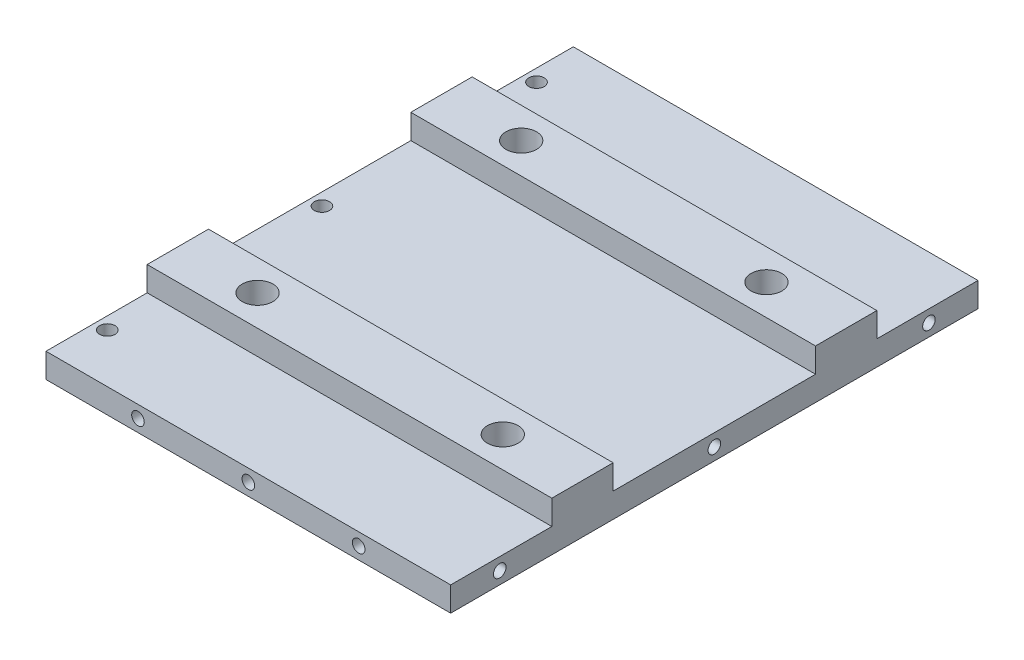
ISO-10303-21;
HEADER;
FILE_DESCRIPTION(('STEP AP214'),'2;1');
FILE_NAME('part.step','',(''),(''),'','','');
FILE_SCHEMA(('AUTOMOTIVE_DESIGN { 1 0 10303 214 1 1 1 1 }'));
ENDSEC;
DATA;
#1=APPLICATION_CONTEXT('core data for automotive mechanical design processes');
#2=APPLICATION_PROTOCOL_DEFINITION('international standard','automotive_design',2000,#1);
#3=PRODUCT_CONTEXT('',#1,'mechanical');
#4=PRODUCT('Part','Part','',(#3));
#5=PRODUCT_RELATED_PRODUCT_CATEGORY('part','',(#4));
#6=PRODUCT_DEFINITION_FORMATION('','',#4);
#7=PRODUCT_DEFINITION_CONTEXT('part definition',#1,'design');
#8=PRODUCT_DEFINITION('design','',#6,#7);
#9=PRODUCT_DEFINITION_SHAPE('','',#8);
#10=(LENGTH_UNIT() NAMED_UNIT(*) SI_UNIT(.MILLI.,.METRE.));
#11=(NAMED_UNIT(*) PLANE_ANGLE_UNIT() SI_UNIT($,.RADIAN.));
#12=(NAMED_UNIT(*) SI_UNIT($,.STERADIAN.) SOLID_ANGLE_UNIT());
#13=UNCERTAINTY_MEASURE_WITH_UNIT(LENGTH_MEASURE(1.E-05),#10,'distance_accuracy_value','');
#14=(GEOMETRIC_REPRESENTATION_CONTEXT(3) GLOBAL_UNCERTAINTY_ASSIGNED_CONTEXT((#13)) GLOBAL_UNIT_ASSIGNED_CONTEXT((#10,
#11,#12)) REPRESENTATION_CONTEXT('',''));
#15=CARTESIAN_POINT('',(0.,0.,0.));
#16=DIRECTION('',(0.,0.,1.));
#17=DIRECTION('',(1.,0.,0.));
#18=AXIS2_PLACEMENT_3D('',#15,#16,#17);
#19=CARTESIAN_POINT('',(0.,0.,0.));
#20=DIRECTION('',(0.,-1.,0.));
#21=DIRECTION('',(0.,0.,-1.));
#22=AXIS2_PLACEMENT_3D('',#19,#20,#21);
#23=PLANE('',#22);
#24=CARTESIAN_POINT('',(53.,0.,21.5));
#25=DIRECTION('',(0.,-1.,0.));
#26=DIRECTION('',(0.,0.,-1.));
#27=AXIS2_PLACEMENT_3D('',#24,#25,#26);
#28=CIRCLE('',#27,2.5);
#29=CARTESIAN_POINT('',(53.,0.,19.));
#30=VERTEX_POINT('',#29);
#31=EDGE_CURVE('E194',#30,#30,#28,.T.);
#32=ORIENTED_EDGE('',*,*,#31,.F.);
#33=EDGE_LOOP('',(#32));
#34=FACE_BOUND('',#33,.T.);
#35=CARTESIAN_POINT('',(13.,0.,21.5));
#36=DIRECTION('',(0.,-1.,0.));
#37=DIRECTION('',(0.,0.,-1.));
#38=AXIS2_PLACEMENT_3D('',#35,#36,#37);
#39=CIRCLE('',#38,2.5);
#40=CARTESIAN_POINT('',(13.,0.,19.));
#41=VERTEX_POINT('',#40);
#42=EDGE_CURVE('E183',#41,#41,#39,.T.);
#43=ORIENTED_EDGE('',*,*,#42,.F.);
#44=EDGE_LOOP('',(#43));
#45=FACE_BOUND('',#44,.T.);
#46=CARTESIAN_POINT('',(13.,0.,-21.5));
#47=DIRECTION('',(0.,1.,0.));
#48=DIRECTION('',(0.,0.,1.));
#49=AXIS2_PLACEMENT_3D('',#46,#47,#48);
#50=CIRCLE('',#49,2.5);
#51=CARTESIAN_POINT('',(13.,0.,-19.));
#52=VERTEX_POINT('',#51);
#53=EDGE_CURVE('E202',#52,#52,#50,.T.);
#54=ORIENTED_EDGE('',*,*,#53,.T.);
#55=EDGE_LOOP('',(#54));
#56=FACE_BOUND('',#55,.T.);
#57=CARTESIAN_POINT('',(1.99999999999988,0.,-35.));
#58=DIRECTION('',(0.,1.,0.));
#59=DIRECTION('',(0.,0.,1.));
#60=AXIS2_PLACEMENT_3D('',#57,#58,#59);
#61=CIRCLE('',#60,1.25);
#62=CARTESIAN_POINT('',(1.99999999999988,0.,-33.75));
#63=VERTEX_POINT('',#62);
#64=EDGE_CURVE('E298',#63,#63,#61,.T.);
#65=ORIENTED_EDGE('',*,*,#64,.T.);
#66=EDGE_LOOP('',(#65));
#67=FACE_BOUND('',#66,.T.);
#68=DIRECTION('',(1.,0.,0.));
#69=VECTOR('',#68,1.);
#70=CARTESIAN_POINT('',(66.,0.,43.));
#71=LINE('',#70,#69);
#72=CARTESIAN_POINT('',(0.,0.,43.));
#73=VERTEX_POINT('',#72);
#74=CARTESIAN_POINT('',(66.,0.,43.));
#75=VERTEX_POINT('',#74);
#76=EDGE_CURVE('E310',#73,#75,#71,.T.);
#77=ORIENTED_EDGE('',*,*,#76,.F.);
#78=DIRECTION('',(0.,0.,1.));
#79=VECTOR('',#78,1.);
#80=CARTESIAN_POINT('',(0.,0.,0.));
#81=LINE('',#80,#79);
#82=CARTESIAN_POINT('',(0.,0.,-43.));
#83=VERTEX_POINT('',#82);
#84=EDGE_CURVE('E331',#83,#73,#81,.T.);
#85=ORIENTED_EDGE('',*,*,#84,.F.);
#86=DIRECTION('',(-1.,0.,0.));
#87=VECTOR('',#86,1.);
#88=CARTESIAN_POINT('',(0.,0.,-43.));
#89=LINE('',#88,#87);
#90=CARTESIAN_POINT('',(66.,0.,-43.));
#91=VERTEX_POINT('',#90);
#92=EDGE_CURVE('E329',#91,#83,#89,.T.);
#93=ORIENTED_EDGE('',*,*,#92,.F.);
#94=DIRECTION('',(0.,0.,-1.));
#95=VECTOR('',#94,1.);
#96=CARTESIAN_POINT('',(66.,0.,-43.));
#97=LINE('',#96,#95);
#98=EDGE_CURVE('E327',#75,#91,#97,.T.);
#99=ORIENTED_EDGE('',*,*,#98,.F.);
#100=EDGE_LOOP('',(#77,#85,#93,#99));
#101=FACE_BOUND('',#100,.T.);
#102=CARTESIAN_POINT('',(2.,0.,0.));
#103=DIRECTION('',(0.,1.,0.));
#104=DIRECTION('',(0.,0.,1.));
#105=AXIS2_PLACEMENT_3D('',#102,#103,#104);
#106=CIRCLE('',#105,1.25);
#107=CARTESIAN_POINT('',(2.,0.,1.25));
#108=VERTEX_POINT('',#107);
#109=EDGE_CURVE('E304',#108,#108,#106,.T.);
#110=ORIENTED_EDGE('',*,*,#109,.T.);
#111=EDGE_LOOP('',(#110));
#112=FACE_BOUND('',#111,.T.);
#113=CARTESIAN_POINT('',(2.00000000000037,0.,35.));
#114=DIRECTION('',(0.,1.,0.));
#115=DIRECTION('',(0.,0.,1.));
#116=AXIS2_PLACEMENT_3D('',#113,#114,#115);
#117=CIRCLE('',#116,1.25);
#118=CARTESIAN_POINT('',(2.00000000000037,0.,36.25));
#119=VERTEX_POINT('',#118);
#120=EDGE_CURVE('E294',#119,#119,#117,.T.);
#121=ORIENTED_EDGE('',*,*,#120,.T.);
#122=EDGE_LOOP('',(#121));
#123=FACE_BOUND('',#122,.T.);
#124=CARTESIAN_POINT('',(53.,0.,-21.5));
#125=DIRECTION('',(0.,1.,0.));
#126=DIRECTION('',(0.,0.,1.));
#127=AXIS2_PLACEMENT_3D('',#124,#125,#126);
#128=CIRCLE('',#127,2.5);
#129=CARTESIAN_POINT('',(53.,0.,-19.));
#130=VERTEX_POINT('',#129);
#131=EDGE_CURVE('E188',#130,#130,#128,.T.);
#132=ORIENTED_EDGE('',*,*,#131,.T.);
#133=EDGE_LOOP('',(#132));
#134=FACE_BOUND('',#133,.T.);
#135=ADVANCED_FACE('F41',(#34,#45,#56,#67,#101,#112,#123,#134),#23,.T.);
#136=CARTESIAN_POINT('',(0.,4.,0.));
#137=DIRECTION('',(0.,-1.,0.));
#138=DIRECTION('',(0.,0.,-1.));
#139=AXIS2_PLACEMENT_3D('',#136,#137,#138);
#140=PLANE('',#139);
#141=CARTESIAN_POINT('',(1.99999999999988,4.,-35.));
#142=DIRECTION('',(0.,1.,0.));
#143=DIRECTION('',(0.,0.,1.));
#144=AXIS2_PLACEMENT_3D('',#141,#142,#143);
#145=CIRCLE('',#144,1.25);
#146=CARTESIAN_POINT('',(1.99999999999988,4.,-33.75));
#147=VERTEX_POINT('',#146);
#148=EDGE_CURVE('E301',#147,#147,#145,.T.);
#149=ORIENTED_EDGE('',*,*,#148,.F.);
#150=EDGE_LOOP('',(#149));
#151=FACE_BOUND('',#150,.T.);
#152=DIRECTION('',(-1.,0.,0.));
#153=VECTOR('',#152,1.);
#154=CARTESIAN_POINT('',(0.,4.,-26.5));
#155=LINE('',#154,#153);
#156=CARTESIAN_POINT('',(66.,4.,-26.5));
#157=VERTEX_POINT('',#156);
#158=CARTESIAN_POINT('',(0.,4.,-26.5));
#159=VERTEX_POINT('',#158);
#160=EDGE_CURVE('E56',#157,#159,#155,.T.);
#161=ORIENTED_EDGE('',*,*,#160,.F.);
#162=DIRECTION('',(0.,0.,-1.));
#163=VECTOR('',#162,1.);
#164=CARTESIAN_POINT('',(66.,4.,-43.));
#165=LINE('',#164,#163);
#166=CARTESIAN_POINT('',(66.,4.,-43.));
#167=VERTEX_POINT('',#166);
#168=EDGE_CURVE('E319',#157,#167,#165,.T.);
#169=ORIENTED_EDGE('',*,*,#168,.T.);
#170=DIRECTION('',(-1.,0.,0.));
#171=VECTOR('',#170,1.);
#172=CARTESIAN_POINT('',(0.,4.,-43.));
#173=LINE('',#172,#171);
#174=CARTESIAN_POINT('',(0.,4.,-43.));
#175=VERTEX_POINT('',#174);
#176=EDGE_CURVE('E322',#167,#175,#173,.T.);
#177=ORIENTED_EDGE('',*,*,#176,.T.);
#178=DIRECTION('',(0.,0.,1.));
#179=VECTOR('',#178,1.);
#180=CARTESIAN_POINT('',(0.,4.,0.));
#181=LINE('',#180,#179);
#182=EDGE_CURVE('E313',#175,#159,#181,.T.);
#183=ORIENTED_EDGE('',*,*,#182,.T.);
#184=EDGE_LOOP('',(#161,#169,#177,#183));
#185=FACE_BOUND('',#184,.T.);
#186=ADVANCED_FACE('F360',(#151,#185),#140,.F.);
#187=CARTESIAN_POINT('',(2.,4.,0.));
#188=DIRECTION('',(0.,1.,0.));
#189=DIRECTION('',(0.,0.,1.));
#190=AXIS2_PLACEMENT_3D('',#187,#188,#189);
#191=CIRCLE('',#190,1.25);
#192=CARTESIAN_POINT('',(2.,4.,1.25));
#193=VERTEX_POINT('',#192);
#194=EDGE_CURVE('E307',#193,#193,#191,.T.);
#195=ORIENTED_EDGE('',*,*,#194,.F.);
#196=EDGE_LOOP('',(#195));
#197=FACE_BOUND('',#196,.T.);
#198=CARTESIAN_POINT('',(66.,4.,16.5));
#199=VERTEX_POINT('',#198);
#200=CARTESIAN_POINT('',(66.,4.,-16.5));
#201=VERTEX_POINT('',#200);
#202=EDGE_CURVE('E64',#199,#201,#165,.T.);
#203=ORIENTED_EDGE('',*,*,#202,.T.);
#204=DIRECTION('',(-1.,0.,0.));
#205=VECTOR('',#204,1.);
#206=CARTESIAN_POINT('',(0.,4.,-16.5));
#207=LINE('',#206,#205);
#208=CARTESIAN_POINT('',(0.,4.,-16.5));
#209=VERTEX_POINT('',#208);
#210=EDGE_CURVE('E205',#201,#209,#207,.T.);
#211=ORIENTED_EDGE('',*,*,#210,.T.);
#212=CARTESIAN_POINT('',(0.,4.,16.5));
#213=VERTEX_POINT('',#212);
#214=EDGE_CURVE('E316',#209,#213,#181,.T.);
#215=ORIENTED_EDGE('',*,*,#214,.T.);
#216=DIRECTION('',(-1.,0.,0.));
#217=VECTOR('',#216,1.);
#218=CARTESIAN_POINT('',(0.,4.,16.5));
#219=LINE('',#218,#217);
#220=EDGE_CURVE('E230',#199,#213,#219,.T.);
#221=ORIENTED_EDGE('',*,*,#220,.F.);
#222=EDGE_LOOP('',(#203,#211,#215,#221));
#223=FACE_BOUND('',#222,.T.);
#224=ADVANCED_FACE('F373',(#197,#223),#140,.F.);
#225=CARTESIAN_POINT('',(66.,4.,43.));
#226=VERTEX_POINT('',#225);
#227=CARTESIAN_POINT('',(66.,4.,26.5));
#228=VERTEX_POINT('',#227);
#229=EDGE_CURVE('E320',#226,#228,#165,.T.);
#230=ORIENTED_EDGE('',*,*,#229,.T.);
#231=DIRECTION('',(-1.,0.,0.));
#232=VECTOR('',#231,1.);
#233=CARTESIAN_POINT('',(0.,4.,26.5));
#234=LINE('',#233,#232);
#235=CARTESIAN_POINT('',(0.,4.,26.5));
#236=VERTEX_POINT('',#235);
#237=EDGE_CURVE('E235',#228,#236,#234,.T.);
#238=ORIENTED_EDGE('',*,*,#237,.T.);
#239=CARTESIAN_POINT('',(0.,4.,43.));
#240=VERTEX_POINT('',#239);
#241=EDGE_CURVE('E317',#236,#240,#181,.T.);
#242=ORIENTED_EDGE('',*,*,#241,.T.);
#243=DIRECTION('',(1.,0.,0.));
#244=VECTOR('',#243,1.);
#245=CARTESIAN_POINT('',(66.,4.,43.));
#246=LINE('',#245,#244);
#247=EDGE_CURVE('E315',#240,#226,#246,.T.);
#248=ORIENTED_EDGE('',*,*,#247,.T.);
#249=EDGE_LOOP('',(#230,#238,#242,#248));
#250=FACE_BOUND('',#249,.T.);
#251=CARTESIAN_POINT('',(2.00000000000037,4.,35.));
#252=DIRECTION('',(0.,1.,0.));
#253=DIRECTION('',(0.,0.,1.));
#254=AXIS2_PLACEMENT_3D('',#251,#252,#253);
#255=CIRCLE('',#254,1.25);
#256=CARTESIAN_POINT('',(2.00000000000037,4.,36.25));
#257=VERTEX_POINT('',#256);
#258=EDGE_CURVE('E295',#257,#257,#255,.T.);
#259=ORIENTED_EDGE('',*,*,#258,.F.);
#260=EDGE_LOOP('',(#259));
#261=FACE_BOUND('',#260,.T.);
#262=ADVANCED_FACE('F388',(#250,#261),#140,.F.);
#263=CARTESIAN_POINT('',(66.,4.,43.));
#264=DIRECTION('',(0.,0.,-1.));
#265=DIRECTION('',(-1.,0.,0.));
#266=AXIS2_PLACEMENT_3D('',#263,#264,#265);
#267=PLANE('',#266);
#268=CARTESIAN_POINT('',(15.,2.,43.));
#269=DIRECTION('',(0.,0.,1.));
#270=DIRECTION('',(1.,0.,0.));
#271=AXIS2_PLACEMENT_3D('',#268,#269,#270);
#272=CIRCLE('',#271,1.02499999999999);
#273=CARTESIAN_POINT('',(16.025,2.,43.));
#274=VERTEX_POINT('',#273);
#275=EDGE_CURVE('E276',#274,#274,#272,.T.);
#276=ORIENTED_EDGE('',*,*,#275,.F.);
#277=EDGE_LOOP('',(#276));
#278=FACE_BOUND('',#277,.T.);
#279=CARTESIAN_POINT('',(33.,2.,43.));
#280=DIRECTION('',(0.,0.,1.));
#281=DIRECTION('',(1.,0.,0.));
#282=AXIS2_PLACEMENT_3D('',#279,#280,#281);
#283=CIRCLE('',#282,1.02499999999999);
#284=CARTESIAN_POINT('',(34.025,2.,43.));
#285=VERTEX_POINT('',#284);
#286=EDGE_CURVE('E282',#285,#285,#283,.T.);
#287=ORIENTED_EDGE('',*,*,#286,.F.);
#288=EDGE_LOOP('',(#287));
#289=FACE_BOUND('',#288,.T.);
#290=CARTESIAN_POINT('',(51.,2.,43.));
#291=DIRECTION('',(0.,0.,1.));
#292=DIRECTION('',(1.,0.,0.));
#293=AXIS2_PLACEMENT_3D('',#290,#291,#292);
#294=CIRCLE('',#293,1.02499999999999);
#295=CARTESIAN_POINT('',(52.025,2.,43.));
#296=VERTEX_POINT('',#295);
#297=EDGE_CURVE('E288',#296,#296,#294,.T.);
#298=ORIENTED_EDGE('',*,*,#297,.F.);
#299=EDGE_LOOP('',(#298));
#300=FACE_BOUND('',#299,.T.);
#301=ORIENTED_EDGE('',*,*,#76,.T.);
#302=DIRECTION('',(0.,-1.,0.));
#303=VECTOR('',#302,1.);
#304=CARTESIAN_POINT('',(66.,4.,43.));
#305=LINE('',#304,#303);
#306=EDGE_CURVE('E49',#226,#75,#305,.T.);
#307=ORIENTED_EDGE('',*,*,#306,.F.);
#308=ORIENTED_EDGE('',*,*,#247,.F.);
#309=DIRECTION('',(0.,-1.,0.));
#310=VECTOR('',#309,1.);
#311=CARTESIAN_POINT('',(0.,4.,43.));
#312=LINE('',#311,#310);
#313=EDGE_CURVE('E11',#240,#73,#312,.T.);
#314=ORIENTED_EDGE('',*,*,#313,.T.);
#315=EDGE_LOOP('',(#301,#307,#308,#314));
#316=FACE_BOUND('',#315,.T.);
#317=ADVANCED_FACE('F43',(#278,#289,#300,#316),#267,.F.);
#318=CARTESIAN_POINT('',(66.,4.,-43.));
#319=DIRECTION('',(-1.,0.,0.));
#320=DIRECTION('',(0.,0.,1.));
#321=AXIS2_PLACEMENT_3D('',#318,#319,#320);
#322=PLANE('',#321);
#323=CARTESIAN_POINT('',(66.,1.99999999999976,35.));
#324=DIRECTION('',(1.,0.,0.));
#325=DIRECTION('',(0.,0.,-1.));
#326=AXIS2_PLACEMENT_3D('',#323,#324,#325);
#327=CIRCLE('',#326,1.025);
#328=CARTESIAN_POINT('',(66.,1.99999999999976,33.975));
#329=VERTEX_POINT('',#328);
#330=EDGE_CURVE('E167',#329,#329,#327,.T.);
#331=ORIENTED_EDGE('',*,*,#330,.F.);
#332=EDGE_LOOP('',(#331));
#333=FACE_BOUND('',#332,.T.);
#334=CARTESIAN_POINT('',(66.,2.,0.));
#335=DIRECTION('',(1.,0.,0.));
#336=DIRECTION('',(0.,0.,-1.));
#337=AXIS2_PLACEMENT_3D('',#334,#335,#336);
#338=CIRCLE('',#337,1.025);
#339=CARTESIAN_POINT('',(66.,2.,-1.025));
#340=VERTEX_POINT('',#339);
#341=EDGE_CURVE('E166',#340,#340,#338,.T.);
#342=ORIENTED_EDGE('',*,*,#341,.F.);
#343=EDGE_LOOP('',(#342));
#344=FACE_BOUND('',#343,.T.);
#345=CARTESIAN_POINT('',(66.,2.00000000000049,-35.));
#346=DIRECTION('',(1.,0.,0.));
#347=DIRECTION('',(0.,0.,-1.));
#348=AXIS2_PLACEMENT_3D('',#345,#346,#347);
#349=CIRCLE('',#348,1.025);
#350=CARTESIAN_POINT('',(66.,2.00000000000049,-36.025));
#351=VERTEX_POINT('',#350);
#352=EDGE_CURVE('E177',#351,#351,#349,.T.);
#353=ORIENTED_EDGE('',*,*,#352,.F.);
#354=EDGE_LOOP('',(#353));
#355=FACE_BOUND('',#354,.T.);
#356=ORIENTED_EDGE('',*,*,#98,.T.);
#357=DIRECTION('',(0.,-1.,0.));
#358=VECTOR('',#357,1.);
#359=CARTESIAN_POINT('',(66.,4.,-43.));
#360=LINE('',#359,#358);
#361=EDGE_CURVE('E335',#167,#91,#360,.T.);
#362=ORIENTED_EDGE('',*,*,#361,.F.);
#363=ORIENTED_EDGE('',*,*,#168,.F.);
#364=DIRECTION('',(0.,-1.,0.));
#365=VECTOR('',#364,1.);
#366=CARTESIAN_POINT('',(66.,8.,-26.5));
#367=LINE('',#366,#365);
#368=CARTESIAN_POINT('',(66.,8.,-26.5));
#369=VERTEX_POINT('',#368);
#370=EDGE_CURVE('E225',#369,#157,#367,.T.);
#371=ORIENTED_EDGE('',*,*,#370,.F.);
#372=DIRECTION('',(0.,0.,-1.));
#373=VECTOR('',#372,1.);
#374=CARTESIAN_POINT('',(66.,8.,0.));
#375=LINE('',#374,#373);
#376=CARTESIAN_POINT('',(66.,8.,-16.5));
#377=VERTEX_POINT('',#376);
#378=EDGE_CURVE('E211',#377,#369,#375,.T.);
#379=ORIENTED_EDGE('',*,*,#378,.F.);
#380=DIRECTION('',(0.,-1.,0.));
#381=VECTOR('',#380,1.);
#382=CARTESIAN_POINT('',(66.,8.,-16.5));
#383=LINE('',#382,#381);
#384=EDGE_CURVE('E228',#377,#201,#383,.T.);
#385=ORIENTED_EDGE('',*,*,#384,.T.);
#386=ORIENTED_EDGE('',*,*,#202,.F.);
#387=DIRECTION('',(0.,-1.,0.));
#388=VECTOR('',#387,1.);
#389=CARTESIAN_POINT('',(66.,8.,16.5));
#390=LINE('',#389,#388);
#391=CARTESIAN_POINT('',(66.,8.,16.5));
#392=VERTEX_POINT('',#391);
#393=EDGE_CURVE('E255',#392,#199,#390,.T.);
#394=ORIENTED_EDGE('',*,*,#393,.F.);
#395=DIRECTION('',(0.,0.,1.));
#396=VECTOR('',#395,1.);
#397=CARTESIAN_POINT('',(66.,8.,0.));
#398=LINE('',#397,#396);
#399=CARTESIAN_POINT('',(66.,8.,26.5));
#400=VERTEX_POINT('',#399);
#401=EDGE_CURVE('E231',#392,#400,#398,.T.);
#402=ORIENTED_EDGE('',*,*,#401,.T.);
#403=DIRECTION('',(0.,-1.,0.));
#404=VECTOR('',#403,1.);
#405=CARTESIAN_POINT('',(66.,8.,26.5));
#406=LINE('',#405,#404);
#407=EDGE_CURVE('E243',#400,#228,#406,.T.);
#408=ORIENTED_EDGE('',*,*,#407,.T.);
#409=ORIENTED_EDGE('',*,*,#229,.F.);
#410=ORIENTED_EDGE('',*,*,#306,.T.);
#411=EDGE_LOOP('',(#356,#362,#363,#371,#379,#385,#386,#394,#402,#408,#409,#410));
#412=FACE_BOUND('',#411,.T.);
#413=ADVANCED_FACE('F342',(#333,#344,#355,#412),#322,.F.);
#414=CARTESIAN_POINT('',(0.,4.,-43.));
#415=DIRECTION('',(0.,0.,1.));
#416=DIRECTION('',(1.,0.,0.));
#417=AXIS2_PLACEMENT_3D('',#414,#415,#416);
#418=PLANE('',#417);
#419=CARTESIAN_POINT('',(15.,2.,-43.));
#420=DIRECTION('',(0.,0.,-1.));
#421=DIRECTION('',(-1.,0.,0.));
#422=AXIS2_PLACEMENT_3D('',#419,#420,#421);
#423=CIRCLE('',#422,1.02499999999999);
#424=CARTESIAN_POINT('',(13.975,2.,-43.));
#425=VERTEX_POINT('',#424);
#426=EDGE_CURVE('E258',#425,#425,#423,.T.);
#427=ORIENTED_EDGE('',*,*,#426,.F.);
#428=EDGE_LOOP('',(#427));
#429=FACE_BOUND('',#428,.T.);
#430=CARTESIAN_POINT('',(33.,2.,-43.));
#431=DIRECTION('',(0.,0.,-1.));
#432=DIRECTION('',(-1.,0.,0.));
#433=AXIS2_PLACEMENT_3D('',#430,#431,#432);
#434=CIRCLE('',#433,1.02499999999999);
#435=CARTESIAN_POINT('',(31.975,2.,-43.));
#436=VERTEX_POINT('',#435);
#437=EDGE_CURVE('E264',#436,#436,#434,.T.);
#438=ORIENTED_EDGE('',*,*,#437,.F.);
#439=EDGE_LOOP('',(#438));
#440=FACE_BOUND('',#439,.T.);
#441=CARTESIAN_POINT('',(51.,2.,-43.));
#442=DIRECTION('',(0.,0.,-1.));
#443=DIRECTION('',(-1.,0.,0.));
#444=AXIS2_PLACEMENT_3D('',#441,#442,#443);
#445=CIRCLE('',#444,1.02499999999999);
#446=CARTESIAN_POINT('',(49.975,2.,-43.));
#447=VERTEX_POINT('',#446);
#448=EDGE_CURVE('E270',#447,#447,#445,.T.);
#449=ORIENTED_EDGE('',*,*,#448,.F.);
#450=EDGE_LOOP('',(#449));
#451=FACE_BOUND('',#450,.T.);
#452=ORIENTED_EDGE('',*,*,#92,.T.);
#453=DIRECTION('',(0.,-1.,0.));
#454=VECTOR('',#453,1.);
#455=CARTESIAN_POINT('',(0.,4.,-43.));
#456=LINE('',#455,#454);
#457=EDGE_CURVE('E325',#175,#83,#456,.T.);
#458=ORIENTED_EDGE('',*,*,#457,.F.);
#459=ORIENTED_EDGE('',*,*,#176,.F.);
#460=ORIENTED_EDGE('',*,*,#361,.T.);
#461=EDGE_LOOP('',(#452,#458,#459,#460));
#462=FACE_BOUND('',#461,.T.);
#463=ADVANCED_FACE('F353',(#429,#440,#451,#462),#418,.F.);
#464=CARTESIAN_POINT('',(0.,4.,0.));
#465=DIRECTION('',(1.,0.,0.));
#466=DIRECTION('',(0.,0.,-1.));
#467=AXIS2_PLACEMENT_3D('',#464,#465,#466);
#468=PLANE('',#467);
#469=ORIENTED_EDGE('',*,*,#84,.T.);
#470=ORIENTED_EDGE('',*,*,#313,.F.);
#471=ORIENTED_EDGE('',*,*,#241,.F.);
#472=DIRECTION('',(0.,-1.,0.));
#473=VECTOR('',#472,1.);
#474=CARTESIAN_POINT('',(0.,8.,26.5));
#475=LINE('',#474,#473);
#476=CARTESIAN_POINT('',(0.,8.,26.5));
#477=VERTEX_POINT('',#476);
#478=EDGE_CURVE('E249',#477,#236,#475,.T.);
#479=ORIENTED_EDGE('',*,*,#478,.F.);
#480=DIRECTION('',(0.,0.,-1.));
#481=VECTOR('',#480,1.);
#482=CARTESIAN_POINT('',(0.,8.,0.));
#483=LINE('',#482,#481);
#484=CARTESIAN_POINT('',(0.,8.,16.5));
#485=VERTEX_POINT('',#484);
#486=EDGE_CURVE('E237',#477,#485,#483,.T.);
#487=ORIENTED_EDGE('',*,*,#486,.T.);
#488=DIRECTION('',(0.,-1.,0.));
#489=VECTOR('',#488,1.);
#490=CARTESIAN_POINT('',(0.,8.,16.5));
#491=LINE('',#490,#489);
#492=EDGE_CURVE('E252',#485,#213,#491,.T.);
#493=ORIENTED_EDGE('',*,*,#492,.T.);
#494=ORIENTED_EDGE('',*,*,#214,.F.);
#495=DIRECTION('',(0.,-1.,0.));
#496=VECTOR('',#495,1.);
#497=CARTESIAN_POINT('',(0.,8.,-16.5));
#498=LINE('',#497,#496);
#499=CARTESIAN_POINT('',(0.,8.,-16.5));
#500=VERTEX_POINT('',#499);
#501=EDGE_CURVE('E217',#500,#209,#498,.T.);
#502=ORIENTED_EDGE('',*,*,#501,.F.);
#503=DIRECTION('',(0.,0.,1.));
#504=VECTOR('',#503,1.);
#505=CARTESIAN_POINT('',(0.,8.,0.));
#506=LINE('',#505,#504);
#507=CARTESIAN_POINT('',(0.,8.,-26.5));
#508=VERTEX_POINT('',#507);
#509=EDGE_CURVE('E215',#508,#500,#506,.T.);
#510=ORIENTED_EDGE('',*,*,#509,.F.);
#511=DIRECTION('',(0.,-1.,0.));
#512=VECTOR('',#511,1.);
#513=CARTESIAN_POINT('',(0.,8.,-26.5));
#514=LINE('',#513,#512);
#515=EDGE_CURVE('E222',#508,#159,#514,.T.);
#516=ORIENTED_EDGE('',*,*,#515,.T.);
#517=ORIENTED_EDGE('',*,*,#182,.F.);
#518=ORIENTED_EDGE('',*,*,#457,.T.);
#519=EDGE_LOOP('',(#469,#470,#471,#479,#487,#493,#494,#502,#510,#516,#517,#518));
#520=FACE_BOUND('',#519,.T.);
#521=ADVANCED_FACE('F356',(#520),#468,.F.);
#522=CARTESIAN_POINT('',(2.,4.,0.));
#523=DIRECTION('',(0.,-1.,0.));
#524=DIRECTION('',(0.,0.,-1.));
#525=AXIS2_PLACEMENT_3D('',#522,#523,#524);
#526=CYLINDRICAL_SURFACE('',#525,1.25);
#527=ORIENTED_EDGE('',*,*,#194,.T.);
#528=EDGE_LOOP('',(#527));
#529=FACE_BOUND('',#528,.T.);
#530=ORIENTED_EDGE('',*,*,#109,.F.);
#531=EDGE_LOOP('',(#530));
#532=FACE_BOUND('',#531,.T.);
#533=ADVANCED_FACE('F417',(#529,#532),#526,.F.);
#534=CARTESIAN_POINT('',(1.99999999999988,4.,-35.));
#535=DIRECTION('',(0.,-1.,0.));
#536=DIRECTION('',(0.,0.,-1.));
#537=AXIS2_PLACEMENT_3D('',#534,#535,#536);
#538=CYLINDRICAL_SURFACE('',#537,1.25);
#539=ORIENTED_EDGE('',*,*,#148,.T.);
#540=EDGE_LOOP('',(#539));
#541=FACE_BOUND('',#540,.T.);
#542=ORIENTED_EDGE('',*,*,#64,.F.);
#543=EDGE_LOOP('',(#542));
#544=FACE_BOUND('',#543,.T.);
#545=ADVANCED_FACE('F473',(#541,#544),#538,.F.);
#546=CARTESIAN_POINT('',(2.00000000000037,4.,35.));
#547=DIRECTION('',(0.,-1.,0.));
#548=DIRECTION('',(0.,0.,-1.));
#549=AXIS2_PLACEMENT_3D('',#546,#547,#548);
#550=CYLINDRICAL_SURFACE('',#549,1.25);
#551=ORIENTED_EDGE('',*,*,#258,.T.);
#552=EDGE_LOOP('',(#551));
#553=FACE_BOUND('',#552,.T.);
#554=ORIENTED_EDGE('',*,*,#120,.F.);
#555=EDGE_LOOP('',(#554));
#556=FACE_BOUND('',#555,.T.);
#557=ADVANCED_FACE('F469',(#553,#556),#550,.F.);
#558=CARTESIAN_POINT('',(51.,2.,34.75));
#559=DIRECTION('',(0.,0.,1.));
#560=DIRECTION('',(1.,0.,0.));
#561=AXIS2_PLACEMENT_3D('',#558,#559,#560);
#562=CONICAL_SURFACE('',#561,1.02499999999998,1.02974425867665);
#563=CARTESIAN_POINT('',(51.,2.,34.1341178654967));
#564=VERTEX_POINT('',#563);
#565=VERTEX_LOOP('',#564);
#566=FACE_BOUND('',#565,.T.);
#567=CARTESIAN_POINT('',(51.,2.,34.75));
#568=DIRECTION('',(0.,0.,1.));
#569=DIRECTION('',(1.,0.,0.));
#570=AXIS2_PLACEMENT_3D('',#567,#568,#569);
#571=CIRCLE('',#570,1.02499999999998);
#572=CARTESIAN_POINT('',(52.025,2.,34.75));
#573=VERTEX_POINT('',#572);
#574=EDGE_CURVE('E291',#573,#573,#571,.T.);
#575=ORIENTED_EDGE('',*,*,#574,.T.);
#576=EDGE_LOOP('',(#575));
#577=FACE_BOUND('',#576,.T.);
#578=ADVANCED_FACE('F465',(#566,#577),#562,.F.);
#579=CARTESIAN_POINT('',(51.,2.,43.));
#580=DIRECTION('',(0.,0.,1.));
#581=DIRECTION('',(1.,0.,0.));
#582=AXIS2_PLACEMENT_3D('',#579,#580,#581);
#583=CYLINDRICAL_SURFACE('',#582,1.02499999999999);
#584=ORIENTED_EDGE('',*,*,#574,.F.);
#585=EDGE_LOOP('',(#584));
#586=FACE_BOUND('',#585,.T.);
#587=ORIENTED_EDGE('',*,*,#297,.T.);
#588=EDGE_LOOP('',(#587));
#589=FACE_BOUND('',#588,.T.);
#590=ADVANCED_FACE('F461',(#586,#589),#583,.F.);
#591=CARTESIAN_POINT('',(33.,2.,34.75));
#592=DIRECTION('',(0.,0.,1.));
#593=DIRECTION('',(1.,0.,0.));
#594=AXIS2_PLACEMENT_3D('',#591,#592,#593);
#595=CONICAL_SURFACE('',#594,1.02499999999998,1.02974425867665);
#596=CARTESIAN_POINT('',(33.,2.,34.1341178654967));
#597=VERTEX_POINT('',#596);
#598=VERTEX_LOOP('',#597);
#599=FACE_BOUND('',#598,.T.);
#600=CARTESIAN_POINT('',(33.,2.,34.75));
#601=DIRECTION('',(0.,0.,1.));
#602=DIRECTION('',(1.,0.,0.));
#603=AXIS2_PLACEMENT_3D('',#600,#601,#602);
#604=CIRCLE('',#603,1.02499999999998);
#605=CARTESIAN_POINT('',(34.025,2.,34.75));
#606=VERTEX_POINT('',#605);
#607=EDGE_CURVE('E285',#606,#606,#604,.T.);
#608=ORIENTED_EDGE('',*,*,#607,.T.);
#609=EDGE_LOOP('',(#608));
#610=FACE_BOUND('',#609,.T.);
#611=ADVANCED_FACE('F457',(#599,#610),#595,.F.);
#612=CARTESIAN_POINT('',(33.,2.,43.));
#613=DIRECTION('',(0.,0.,1.));
#614=DIRECTION('',(1.,0.,0.));
#615=AXIS2_PLACEMENT_3D('',#612,#613,#614);
#616=CYLINDRICAL_SURFACE('',#615,1.02499999999999);
#617=ORIENTED_EDGE('',*,*,#607,.F.);
#618=EDGE_LOOP('',(#617));
#619=FACE_BOUND('',#618,.T.);
#620=ORIENTED_EDGE('',*,*,#286,.T.);
#621=EDGE_LOOP('',(#620));
#622=FACE_BOUND('',#621,.T.);
#623=ADVANCED_FACE('F453',(#619,#622),#616,.F.);
#624=CARTESIAN_POINT('',(15.,2.,34.75));
#625=DIRECTION('',(0.,0.,1.));
#626=DIRECTION('',(1.,0.,0.));
#627=AXIS2_PLACEMENT_3D('',#624,#625,#626);
#628=CONICAL_SURFACE('',#627,1.02499999999999,1.02974425867666);
#629=CARTESIAN_POINT('',(15.,2.,34.1341178654967));
#630=VERTEX_POINT('',#629);
#631=VERTEX_LOOP('',#630);
#632=FACE_BOUND('',#631,.T.);
#633=CARTESIAN_POINT('',(15.,2.,34.75));
#634=DIRECTION('',(0.,0.,1.));
#635=DIRECTION('',(1.,0.,0.));
#636=AXIS2_PLACEMENT_3D('',#633,#634,#635);
#637=CIRCLE('',#636,1.02499999999999);
#638=CARTESIAN_POINT('',(16.025,2.,34.75));
#639=VERTEX_POINT('',#638);
#640=EDGE_CURVE('E279',#639,#639,#637,.T.);
#641=ORIENTED_EDGE('',*,*,#640,.T.);
#642=EDGE_LOOP('',(#641));
#643=FACE_BOUND('',#642,.T.);
#644=ADVANCED_FACE('F449',(#632,#643),#628,.F.);
#645=CARTESIAN_POINT('',(15.,2.,43.));
#646=DIRECTION('',(0.,0.,1.));
#647=DIRECTION('',(1.,0.,0.));
#648=AXIS2_PLACEMENT_3D('',#645,#646,#647);
#649=CYLINDRICAL_SURFACE('',#648,1.02499999999999);
#650=ORIENTED_EDGE('',*,*,#640,.F.);
#651=EDGE_LOOP('',(#650));
#652=FACE_BOUND('',#651,.T.);
#653=ORIENTED_EDGE('',*,*,#275,.T.);
#654=EDGE_LOOP('',(#653));
#655=FACE_BOUND('',#654,.T.);
#656=ADVANCED_FACE('F441',(#652,#655),#649,.F.);
#657=CARTESIAN_POINT('',(51.,2.,-34.75));
#658=DIRECTION('',(0.,0.,-1.));
#659=DIRECTION('',(-1.,0.,0.));
#660=AXIS2_PLACEMENT_3D('',#657,#658,#659);
#661=CONICAL_SURFACE('',#660,1.02499999999998,1.02974425867665);
#662=CARTESIAN_POINT('',(51.,2.,-34.1341178654967));
#663=VERTEX_POINT('',#662);
#664=VERTEX_LOOP('',#663);
#665=FACE_BOUND('',#664,.T.);
#666=CARTESIAN_POINT('',(51.,2.,-34.75));
#667=DIRECTION('',(0.,0.,-1.));
#668=DIRECTION('',(-1.,0.,0.));
#669=AXIS2_PLACEMENT_3D('',#666,#667,#668);
#670=CIRCLE('',#669,1.02499999999998);
#671=CARTESIAN_POINT('',(49.975,2.,-34.75));
#672=VERTEX_POINT('',#671);
#673=EDGE_CURVE('E273',#672,#672,#670,.T.);
#674=ORIENTED_EDGE('',*,*,#673,.T.);
#675=EDGE_LOOP('',(#674));
#676=FACE_BOUND('',#675,.T.);
#677=ADVANCED_FACE('F431',(#665,#676),#661,.F.);
#678=CARTESIAN_POINT('',(51.,2.,-43.));
#679=DIRECTION('',(0.,0.,-1.));
#680=DIRECTION('',(-1.,0.,0.));
#681=AXIS2_PLACEMENT_3D('',#678,#679,#680);
#682=CYLINDRICAL_SURFACE('',#681,1.02499999999999);
#683=ORIENTED_EDGE('',*,*,#673,.F.);
#684=EDGE_LOOP('',(#683));
#685=FACE_BOUND('',#684,.T.);
#686=ORIENTED_EDGE('',*,*,#448,.T.);
#687=EDGE_LOOP('',(#686));
#688=FACE_BOUND('',#687,.T.);
#689=ADVANCED_FACE('F428',(#685,#688),#682,.F.);
#690=CARTESIAN_POINT('',(33.,2.,-34.75));
#691=DIRECTION('',(0.,0.,-1.));
#692=DIRECTION('',(-1.,0.,0.));
#693=AXIS2_PLACEMENT_3D('',#690,#691,#692);
#694=CONICAL_SURFACE('',#693,1.02499999999998,1.02974425867665);
#695=CARTESIAN_POINT('',(33.,2.,-34.1341178654967));
#696=VERTEX_POINT('',#695);
#697=VERTEX_LOOP('',#696);
#698=FACE_BOUND('',#697,.T.);
#699=CARTESIAN_POINT('',(33.,2.,-34.75));
#700=DIRECTION('',(0.,0.,-1.));
#701=DIRECTION('',(-1.,0.,0.));
#702=AXIS2_PLACEMENT_3D('',#699,#700,#701);
#703=CIRCLE('',#702,1.02499999999998);
#704=CARTESIAN_POINT('',(31.975,2.,-34.75));
#705=VERTEX_POINT('',#704);
#706=EDGE_CURVE('E267',#705,#705,#703,.T.);
#707=ORIENTED_EDGE('',*,*,#706,.T.);
#708=EDGE_LOOP('',(#707));
#709=FACE_BOUND('',#708,.T.);
#710=ADVANCED_FACE('F430',(#698,#709),#694,.F.);
#711=CARTESIAN_POINT('',(33.,2.,-43.));
#712=DIRECTION('',(0.,0.,-1.));
#713=DIRECTION('',(-1.,0.,0.));
#714=AXIS2_PLACEMENT_3D('',#711,#712,#713);
#715=CYLINDRICAL_SURFACE('',#714,1.02499999999999);
#716=ORIENTED_EDGE('',*,*,#706,.F.);
#717=EDGE_LOOP('',(#716));
#718=FACE_BOUND('',#717,.T.);
#719=ORIENTED_EDGE('',*,*,#437,.T.);
#720=EDGE_LOOP('',(#719));
#721=FACE_BOUND('',#720,.T.);
#722=ADVANCED_FACE('F438',(#718,#721),#715,.F.);
#723=CARTESIAN_POINT('',(15.,2.,-34.75));
#724=DIRECTION('',(0.,0.,-1.));
#725=DIRECTION('',(-1.,0.,0.));
#726=AXIS2_PLACEMENT_3D('',#723,#724,#725);
#727=CONICAL_SURFACE('',#726,1.02499999999999,1.02974425867666);
#728=CARTESIAN_POINT('',(15.,2.,-34.1341178654967));
#729=VERTEX_POINT('',#728);
#730=VERTEX_LOOP('',#729);
#731=FACE_BOUND('',#730,.T.);
#732=CARTESIAN_POINT('',(15.,2.,-34.75));
#733=DIRECTION('',(0.,0.,-1.));
#734=DIRECTION('',(-1.,0.,0.));
#735=AXIS2_PLACEMENT_3D('',#732,#733,#734);
#736=CIRCLE('',#735,1.02499999999999);
#737=CARTESIAN_POINT('',(13.975,2.,-34.75));
#738=VERTEX_POINT('',#737);
#739=EDGE_CURVE('E261',#738,#738,#736,.T.);
#740=ORIENTED_EDGE('',*,*,#739,.T.);
#741=EDGE_LOOP('',(#740));
#742=FACE_BOUND('',#741,.T.);
#743=ADVANCED_FACE('F524',(#731,#742),#727,.F.);
#744=CARTESIAN_POINT('',(15.,2.,-43.));
#745=DIRECTION('',(0.,0.,-1.));
#746=DIRECTION('',(-1.,0.,0.));
#747=AXIS2_PLACEMENT_3D('',#744,#745,#746);
#748=CYLINDRICAL_SURFACE('',#747,1.02499999999999);
#749=ORIENTED_EDGE('',*,*,#739,.F.);
#750=EDGE_LOOP('',(#749));
#751=FACE_BOUND('',#750,.T.);
#752=ORIENTED_EDGE('',*,*,#426,.T.);
#753=EDGE_LOOP('',(#752));
#754=FACE_BOUND('',#753,.T.);
#755=ADVANCED_FACE('F521',(#751,#754),#748,.F.);
#756=CARTESIAN_POINT('',(0.,8.,16.5));
#757=DIRECTION('',(0.,0.,1.));
#758=DIRECTION('',(1.,0.,0.));
#759=AXIS2_PLACEMENT_3D('',#756,#757,#758);
#760=PLANE('',#759);
#761=ORIENTED_EDGE('',*,*,#220,.T.);
#762=ORIENTED_EDGE('',*,*,#492,.F.);
#763=DIRECTION('',(-1.,0.,0.));
#764=VECTOR('',#763,1.);
#765=CARTESIAN_POINT('',(0.,8.,16.5));
#766=LINE('',#765,#764);
#767=EDGE_CURVE('E234',#392,#485,#766,.T.);
#768=ORIENTED_EDGE('',*,*,#767,.F.);
#769=ORIENTED_EDGE('',*,*,#393,.T.);
#770=EDGE_LOOP('',(#761,#762,#768,#769));
#771=FACE_BOUND('',#770,.T.);
#772=ADVANCED_FACE('F378',(#771),#760,.F.);
#773=CARTESIAN_POINT('',(0.,8.,26.5));
#774=DIRECTION('',(0.,0.,1.));
#775=DIRECTION('',(1.,0.,0.));
#776=AXIS2_PLACEMENT_3D('',#773,#774,#775);
#777=PLANE('',#776);
#778=ORIENTED_EDGE('',*,*,#237,.F.);
#779=ORIENTED_EDGE('',*,*,#407,.F.);
#780=DIRECTION('',(-1.,0.,0.));
#781=VECTOR('',#780,1.);
#782=CARTESIAN_POINT('',(0.,8.,26.5));
#783=LINE('',#782,#781);
#784=EDGE_CURVE('E240',#400,#477,#783,.T.);
#785=ORIENTED_EDGE('',*,*,#784,.T.);
#786=ORIENTED_EDGE('',*,*,#478,.T.);
#787=EDGE_LOOP('',(#778,#779,#785,#786));
#788=FACE_BOUND('',#787,.T.);
#789=ADVANCED_FACE('F385',(#788),#777,.T.);
#790=CARTESIAN_POINT('',(0.,8.,0.));
#791=DIRECTION('',(0.,1.,0.));
#792=DIRECTION('',(0.,0.,1.));
#793=AXIS2_PLACEMENT_3D('',#790,#791,#792);
#794=PLANE('',#793);
#795=CARTESIAN_POINT('',(53.,8.,21.5));
#796=DIRECTION('',(0.,-1.,0.));
#797=DIRECTION('',(0.,0.,-1.));
#798=AXIS2_PLACEMENT_3D('',#795,#796,#797);
#799=CIRCLE('',#798,2.5);
#800=CARTESIAN_POINT('',(53.,8.,19.));
#801=VERTEX_POINT('',#800);
#802=EDGE_CURVE('E191',#801,#801,#799,.T.);
#803=ORIENTED_EDGE('',*,*,#802,.T.);
#804=EDGE_LOOP('',(#803));
#805=FACE_BOUND('',#804,.T.);
#806=CARTESIAN_POINT('',(13.,8.,21.5));
#807=DIRECTION('',(0.,-1.,0.));
#808=DIRECTION('',(0.,0.,-1.));
#809=AXIS2_PLACEMENT_3D('',#806,#807,#808);
#810=CIRCLE('',#809,2.5);
#811=CARTESIAN_POINT('',(13.,8.,19.));
#812=VERTEX_POINT('',#811);
#813=EDGE_CURVE('E197',#812,#812,#810,.T.);
#814=ORIENTED_EDGE('',*,*,#813,.T.);
#815=EDGE_LOOP('',(#814));
#816=FACE_BOUND('',#815,.T.);
#817=ORIENTED_EDGE('',*,*,#401,.F.);
#818=ORIENTED_EDGE('',*,*,#767,.T.);
#819=ORIENTED_EDGE('',*,*,#486,.F.);
#820=ORIENTED_EDGE('',*,*,#784,.F.);
#821=EDGE_LOOP('',(#817,#818,#819,#820));
#822=FACE_BOUND('',#821,.T.);
#823=ADVANCED_FACE('F383',(#805,#816,#822),#794,.T.);
#824=CARTESIAN_POINT('',(0.,8.,-16.5));
#825=DIRECTION('',(0.,0.,1.));
#826=DIRECTION('',(1.,0.,0.));
#827=AXIS2_PLACEMENT_3D('',#824,#825,#826);
#828=PLANE('',#827);
#829=ORIENTED_EDGE('',*,*,#210,.F.);
#830=ORIENTED_EDGE('',*,*,#384,.F.);
#831=DIRECTION('',(-1.,0.,0.));
#832=VECTOR('',#831,1.);
#833=CARTESIAN_POINT('',(0.,8.,-16.5));
#834=LINE('',#833,#832);
#835=EDGE_CURVE('E208',#377,#500,#834,.T.);
#836=ORIENTED_EDGE('',*,*,#835,.T.);
#837=ORIENTED_EDGE('',*,*,#501,.T.);
#838=EDGE_LOOP('',(#829,#830,#836,#837));
#839=FACE_BOUND('',#838,.T.);
#840=ADVANCED_FACE('F372',(#839),#828,.T.);
#841=CARTESIAN_POINT('',(0.,8.,-26.5));
#842=DIRECTION('',(0.,0.,1.));
#843=DIRECTION('',(1.,0.,0.));
#844=AXIS2_PLACEMENT_3D('',#841,#842,#843);
#845=PLANE('',#844);
#846=ORIENTED_EDGE('',*,*,#160,.T.);
#847=ORIENTED_EDGE('',*,*,#515,.F.);
#848=DIRECTION('',(-1.,0.,0.));
#849=VECTOR('',#848,1.);
#850=CARTESIAN_POINT('',(0.,8.,-26.5));
#851=LINE('',#850,#849);
#852=EDGE_CURVE('E213',#369,#508,#851,.T.);
#853=ORIENTED_EDGE('',*,*,#852,.F.);
#854=ORIENTED_EDGE('',*,*,#370,.T.);
#855=EDGE_LOOP('',(#846,#847,#853,#854));
#856=FACE_BOUND('',#855,.T.);
#857=ADVANCED_FACE('F365',(#856),#845,.F.);
#858=CARTESIAN_POINT('',(0.,8.,0.));
#859=DIRECTION('',(0.,1.,0.));
#860=DIRECTION('',(0.,0.,1.));
#861=AXIS2_PLACEMENT_3D('',#858,#859,#860);
#862=PLANE('',#861);
#863=CARTESIAN_POINT('',(53.,8.,-21.5));
#864=DIRECTION('',(0.,1.,0.));
#865=DIRECTION('',(0.,0.,1.));
#866=AXIS2_PLACEMENT_3D('',#863,#864,#865);
#867=CIRCLE('',#866,2.5);
#868=CARTESIAN_POINT('',(53.,8.,-19.));
#869=VERTEX_POINT('',#868);
#870=EDGE_CURVE('E184',#869,#869,#867,.T.);
#871=ORIENTED_EDGE('',*,*,#870,.F.);
#872=EDGE_LOOP('',(#871));
#873=FACE_BOUND('',#872,.T.);
#874=CARTESIAN_POINT('',(13.,8.,-21.5));
#875=DIRECTION('',(0.,1.,0.));
#876=DIRECTION('',(0.,0.,1.));
#877=AXIS2_PLACEMENT_3D('',#874,#875,#876);
#878=CIRCLE('',#877,2.5);
#879=CARTESIAN_POINT('',(13.,8.,-19.));
#880=VERTEX_POINT('',#879);
#881=EDGE_CURVE('E187',#880,#880,#878,.T.);
#882=ORIENTED_EDGE('',*,*,#881,.F.);
#883=EDGE_LOOP('',(#882));
#884=FACE_BOUND('',#883,.T.);
#885=ORIENTED_EDGE('',*,*,#835,.F.);
#886=ORIENTED_EDGE('',*,*,#378,.T.);
#887=ORIENTED_EDGE('',*,*,#852,.T.);
#888=ORIENTED_EDGE('',*,*,#509,.T.);
#889=EDGE_LOOP('',(#885,#886,#887,#888));
#890=FACE_BOUND('',#889,.T.);
#891=ADVANCED_FACE('F368',(#873,#884,#890),#862,.T.);
#892=CARTESIAN_POINT('',(13.,0.,-21.5));
#893=DIRECTION('',(0.,1.,0.));
#894=DIRECTION('',(0.,0.,1.));
#895=AXIS2_PLACEMENT_3D('',#892,#893,#894);
#896=CYLINDRICAL_SURFACE('',#895,2.5);
#897=ORIENTED_EDGE('',*,*,#53,.F.);
#898=EDGE_LOOP('',(#897));
#899=FACE_BOUND('',#898,.T.);
#900=ORIENTED_EDGE('',*,*,#881,.T.);
#901=EDGE_LOOP('',(#900));
#902=FACE_BOUND('',#901,.T.);
#903=ADVANCED_FACE('F492',(#899,#902),#896,.F.);
#904=CARTESIAN_POINT('',(53.,0.,-21.5));
#905=DIRECTION('',(0.,1.,0.));
#906=DIRECTION('',(0.,0.,1.));
#907=AXIS2_PLACEMENT_3D('',#904,#905,#906);
#908=CYLINDRICAL_SURFACE('',#907,2.5);
#909=ORIENTED_EDGE('',*,*,#131,.F.);
#910=EDGE_LOOP('',(#909));
#911=FACE_BOUND('',#910,.T.);
#912=ORIENTED_EDGE('',*,*,#870,.T.);
#913=EDGE_LOOP('',(#912));
#914=FACE_BOUND('',#913,.T.);
#915=ADVANCED_FACE('F488',(#911,#914),#908,.F.);
#916=CARTESIAN_POINT('',(13.,0.,21.5));
#917=DIRECTION('',(0.,1.,0.));
#918=DIRECTION('',(0.,0.,1.));
#919=AXIS2_PLACEMENT_3D('',#916,#917,#918);
#920=CYLINDRICAL_SURFACE('',#919,2.5);
#921=ORIENTED_EDGE('',*,*,#42,.T.);
#922=EDGE_LOOP('',(#921));
#923=FACE_BOUND('',#922,.T.);
#924=ORIENTED_EDGE('',*,*,#813,.F.);
#925=EDGE_LOOP('',(#924));
#926=FACE_BOUND('',#925,.T.);
#927=ADVANCED_FACE('F491',(#923,#926),#920,.F.);
#928=CARTESIAN_POINT('',(53.,0.,21.5));
#929=DIRECTION('',(0.,1.,0.));
#930=DIRECTION('',(0.,0.,1.));
#931=AXIS2_PLACEMENT_3D('',#928,#929,#930);
#932=CYLINDRICAL_SURFACE('',#931,2.5);
#933=ORIENTED_EDGE('',*,*,#31,.T.);
#934=EDGE_LOOP('',(#933));
#935=FACE_BOUND('',#934,.T.);
#936=ORIENTED_EDGE('',*,*,#802,.F.);
#937=EDGE_LOOP('',(#936));
#938=FACE_BOUND('',#937,.T.);
#939=ADVANCED_FACE('F617',(#935,#938),#932,.F.);
#940=CARTESIAN_POINT('',(58.75,2.00000000000049,-35.));
#941=DIRECTION('',(1.,0.,0.));
#942=DIRECTION('',(0.,0.,-1.));
#943=AXIS2_PLACEMENT_3D('',#940,#941,#942);
#944=CONICAL_SURFACE('',#943,1.025,1.02974425867665);
#945=CARTESIAN_POINT('',(58.1341178654968,2.00000000000049,-35.));
#946=VERTEX_POINT('',#945);
#947=VERTEX_LOOP('',#946);
#948=FACE_BOUND('',#947,.T.);
#949=CARTESIAN_POINT('',(58.75,2.00000000000049,-35.));
#950=DIRECTION('',(1.,0.,0.));
#951=DIRECTION('',(0.,0.,-1.));
#952=AXIS2_PLACEMENT_3D('',#949,#950,#951);
#953=CIRCLE('',#952,1.025);
#954=CARTESIAN_POINT('',(58.75,2.00000000000049,-36.025));
#955=VERTEX_POINT('',#954);
#956=EDGE_CURVE('E180',#955,#955,#953,.T.);
#957=ORIENTED_EDGE('',*,*,#956,.T.);
#958=EDGE_LOOP('',(#957));
#959=FACE_BOUND('',#958,.T.);
#960=ADVANCED_FACE('F625',(#948,#959),#944,.F.);
#961=CARTESIAN_POINT('',(66.,2.00000000000049,-35.));
#962=DIRECTION('',(1.,0.,0.));
#963=DIRECTION('',(0.,0.,-1.));
#964=AXIS2_PLACEMENT_3D('',#961,#962,#963);
#965=CYLINDRICAL_SURFACE('',#964,1.025);
#966=ORIENTED_EDGE('',*,*,#956,.F.);
#967=EDGE_LOOP('',(#966));
#968=FACE_BOUND('',#967,.T.);
#969=ORIENTED_EDGE('',*,*,#352,.T.);
#970=EDGE_LOOP('',(#969));
#971=FACE_BOUND('',#970,.T.);
#972=ADVANCED_FACE('F634',(#968,#971),#965,.F.);
#973=CARTESIAN_POINT('',(58.75,2.,0.));
#974=DIRECTION('',(1.,0.,0.));
#975=DIRECTION('',(0.,0.,-1.));
#976=AXIS2_PLACEMENT_3D('',#973,#974,#975);
#977=CONICAL_SURFACE('',#976,1.025,1.02974425867665);
#978=CARTESIAN_POINT('',(58.1341178654968,2.,0.));
#979=VERTEX_POINT('',#978);
#980=VERTEX_LOOP('',#979);
#981=FACE_BOUND('',#980,.T.);
#982=CARTESIAN_POINT('',(58.75,2.,0.));
#983=DIRECTION('',(1.,0.,0.));
#984=DIRECTION('',(0.,0.,-1.));
#985=AXIS2_PLACEMENT_3D('',#982,#983,#984);
#986=CIRCLE('',#985,1.025);
#987=CARTESIAN_POINT('',(58.75,2.,-1.025));
#988=VERTEX_POINT('',#987);
#989=EDGE_CURVE('E170',#988,#988,#986,.T.);
#990=ORIENTED_EDGE('',*,*,#989,.T.);
#991=EDGE_LOOP('',(#990));
#992=FACE_BOUND('',#991,.T.);
#993=ADVANCED_FACE('F642',(#981,#992),#977,.F.);
#994=CARTESIAN_POINT('',(66.,2.,0.));
#995=DIRECTION('',(1.,0.,0.));
#996=DIRECTION('',(0.,0.,-1.));
#997=AXIS2_PLACEMENT_3D('',#994,#995,#996);
#998=CYLINDRICAL_SURFACE('',#997,1.025);
#999=ORIENTED_EDGE('',*,*,#989,.F.);
#1000=EDGE_LOOP('',(#999));
#1001=FACE_BOUND('',#1000,.T.);
#1002=ORIENTED_EDGE('',*,*,#341,.T.);
#1003=EDGE_LOOP('',(#1002));
#1004=FACE_BOUND('',#1003,.T.);
#1005=ADVANCED_FACE('F160',(#1001,#1004),#998,.F.);
#1006=CARTESIAN_POINT('',(58.75,1.99999999999976,35.));
#1007=DIRECTION('',(1.,0.,0.));
#1008=DIRECTION('',(0.,0.,-1.));
#1009=AXIS2_PLACEMENT_3D('',#1006,#1007,#1008);
#1010=CONICAL_SURFACE('',#1009,1.025,1.02974425867665);
#1011=CARTESIAN_POINT('',(58.1341178654968,1.99999999999975,35.));
#1012=VERTEX_POINT('',#1011);
#1013=VERTEX_LOOP('',#1012);
#1014=FACE_BOUND('',#1013,.T.);
#1015=CARTESIAN_POINT('',(58.75,1.99999999999976,35.));
#1016=DIRECTION('',(1.,0.,0.));
#1017=DIRECTION('',(0.,0.,-1.));
#1018=AXIS2_PLACEMENT_3D('',#1015,#1016,#1017);
#1019=CIRCLE('',#1018,1.025);
#1020=CARTESIAN_POINT('',(58.75,1.99999999999976,33.975));
#1021=VERTEX_POINT('',#1020);
#1022=EDGE_CURVE('E164',#1021,#1021,#1019,.T.);
#1023=ORIENTED_EDGE('',*,*,#1022,.T.);
#1024=EDGE_LOOP('',(#1023));
#1025=FACE_BOUND('',#1024,.T.);
#1026=ADVANCED_FACE('F156',(#1014,#1025),#1010,.F.);
#1027=CARTESIAN_POINT('',(66.,1.99999999999976,35.));
#1028=DIRECTION('',(1.,0.,0.));
#1029=DIRECTION('',(0.,0.,-1.));
#1030=AXIS2_PLACEMENT_3D('',#1027,#1028,#1029);
#1031=CYLINDRICAL_SURFACE('',#1030,1.025);
#1032=ORIENTED_EDGE('',*,*,#1022,.F.);
#1033=EDGE_LOOP('',(#1032));
#1034=FACE_BOUND('',#1033,.T.);
#1035=ORIENTED_EDGE('',*,*,#330,.T.);
#1036=EDGE_LOOP('',(#1035));
#1037=FACE_BOUND('',#1036,.T.);
#1038=ADVANCED_FACE('F159',(#1034,#1037),#1031,.F.);
#1039=CLOSED_SHELL('',(#135,#186,#224,#262,#317,#413,#463,#521,#533,#545,#557,#578,#590,#611,
#623,#644,#656,#677,#689,#710,#722,#743,#755,#772,#789,#823,#840,#857,#891,#903,#915,#927,#939,
#960,#972,#993,#1005,#1026,#1038));
#1040=MANIFOLD_SOLID_BREP('B2',#1039);
#1041=ADVANCED_BREP_SHAPE_REPRESENTATION('',(#18,#1040),#14);
#1042=SHAPE_DEFINITION_REPRESENTATION(#9,#1041);
ENDSEC;
END-ISO-10303-21;
